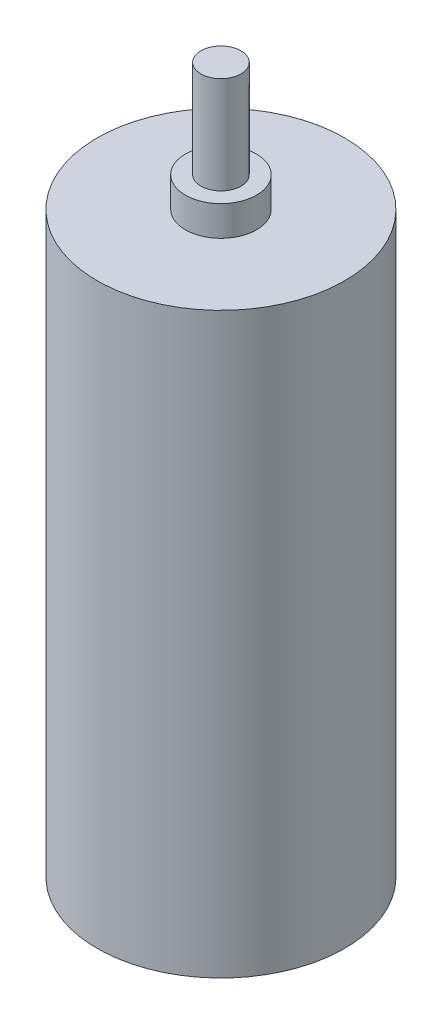
ISO-10303-21;
HEADER;
FILE_DESCRIPTION(('STEP AP214'),'2;1');
FILE_NAME('part.step','',(''),(''),'','','');
FILE_SCHEMA(('AUTOMOTIVE_DESIGN { 1 0 10303 214 1 1 1 1 }'));
ENDSEC;
DATA;
#1=APPLICATION_CONTEXT('core data for automotive mechanical design processes');
#2=APPLICATION_PROTOCOL_DEFINITION('international standard','automotive_design',2000,#1);
#3=PRODUCT_CONTEXT('',#1,'mechanical');
#4=PRODUCT('Part','Part','',(#3));
#5=PRODUCT_RELATED_PRODUCT_CATEGORY('part','',(#4));
#6=PRODUCT_DEFINITION_FORMATION('','',#4);
#7=PRODUCT_DEFINITION_CONTEXT('part definition',#1,'design');
#8=PRODUCT_DEFINITION('design','',#6,#7);
#9=PRODUCT_DEFINITION_SHAPE('','',#8);
#10=(LENGTH_UNIT() NAMED_UNIT(*) SI_UNIT(.MILLI.,.METRE.));
#11=(NAMED_UNIT(*) PLANE_ANGLE_UNIT() SI_UNIT($,.RADIAN.));
#12=(NAMED_UNIT(*) SI_UNIT($,.STERADIAN.) SOLID_ANGLE_UNIT());
#13=UNCERTAINTY_MEASURE_WITH_UNIT(LENGTH_MEASURE(1.E-05),#10,'distance_accuracy_value','');
#14=(GEOMETRIC_REPRESENTATION_CONTEXT(3) GLOBAL_UNCERTAINTY_ASSIGNED_CONTEXT((#13)) GLOBAL_UNIT_ASSIGNED_CONTEXT((#10,
#11,#12)) REPRESENTATION_CONTEXT('',''));
#15=CARTESIAN_POINT('',(0.,0.,0.));
#16=DIRECTION('',(0.,0.,1.));
#17=DIRECTION('',(1.,0.,0.));
#18=AXIS2_PLACEMENT_3D('',#15,#16,#17);
#19=CARTESIAN_POINT('',(0.,57.7,0.));
#20=DIRECTION('',(0.,-1.,0.));
#21=DIRECTION('',(0.,0.,1.));
#22=AXIS2_PLACEMENT_3D('',#19,#20,#21);
#23=CYLINDRICAL_SURFACE('',#22,12.35);
#24=CARTESIAN_POINT('',(0.,57.7,0.));
#25=DIRECTION('',(0.,-1.,0.));
#26=DIRECTION('',(0.,0.,-1.));
#27=AXIS2_PLACEMENT_3D('',#24,#25,#26);
#28=CIRCLE('',#27,12.35);
#29=CARTESIAN_POINT('',(0.,57.7,-12.35));
#30=VERTEX_POINT('',#29);
#31=EDGE_CURVE('E59',#30,#30,#28,.T.);
#32=ORIENTED_EDGE('',*,*,#31,.T.);
#33=EDGE_LOOP('',(#32));
#34=FACE_BOUND('',#33,.T.);
#35=CARTESIAN_POINT('',(0.,0.,0.));
#36=DIRECTION('',(0.,-1.,0.));
#37=DIRECTION('',(0.,0.,-1.));
#38=AXIS2_PLACEMENT_3D('',#35,#36,#37);
#39=CIRCLE('',#38,12.35);
#40=CARTESIAN_POINT('',(0.,0.,-12.35));
#41=VERTEX_POINT('',#40);
#42=EDGE_CURVE('E48',#41,#41,#39,.T.);
#43=ORIENTED_EDGE('',*,*,#42,.F.);
#44=EDGE_LOOP('',(#43));
#45=FACE_BOUND('',#44,.T.);
#46=ADVANCED_FACE('F45',(#34,#45),#23,.T.);
#47=CARTESIAN_POINT('',(0.,57.7,0.));
#48=DIRECTION('',(0.,1.,0.));
#49=DIRECTION('',(0.,0.,-1.));
#50=AXIS2_PLACEMENT_3D('',#47,#48,#49);
#51=PLANE('',#50);
#52=CARTESIAN_POINT('',(0.,57.7,0.));
#53=DIRECTION('',(0.,-1.,0.));
#54=DIRECTION('',(0.,0.,-1.));
#55=AXIS2_PLACEMENT_3D('',#52,#53,#54);
#56=CIRCLE('',#55,3.55);
#57=CARTESIAN_POINT('',(0.,57.7,-3.55));
#58=VERTEX_POINT('',#57);
#59=EDGE_CURVE('E53',#58,#58,#56,.T.);
#60=ORIENTED_EDGE('',*,*,#59,.T.);
#61=EDGE_LOOP('',(#60));
#62=FACE_BOUND('',#61,.T.);
#63=ORIENTED_EDGE('',*,*,#31,.F.);
#64=EDGE_LOOP('',(#63));
#65=FACE_BOUND('',#64,.T.);
#66=ADVANCED_FACE('F78',(#62,#65),#51,.T.);
#67=CARTESIAN_POINT('',(0.,0.,0.));
#68=DIRECTION('',(0.,1.,0.));
#69=DIRECTION('',(0.,0.,-1.));
#70=AXIS2_PLACEMENT_3D('',#67,#68,#69);
#71=PLANE('',#70);
#72=ORIENTED_EDGE('',*,*,#42,.T.);
#73=EDGE_LOOP('',(#72));
#74=FACE_BOUND('',#73,.T.);
#75=ADVANCED_FACE('F75',(#74),#71,.F.);
#76=CARTESIAN_POINT('',(0.,60.7,0.));
#77=DIRECTION('',(0.,-1.,0.));
#78=DIRECTION('',(0.,0.,1.));
#79=AXIS2_PLACEMENT_3D('',#76,#77,#78);
#80=CYLINDRICAL_SURFACE('',#79,3.55);
#81=CARTESIAN_POINT('',(0.,60.7,0.));
#82=DIRECTION('',(0.,-1.,0.));
#83=DIRECTION('',(0.,0.,-1.));
#84=AXIS2_PLACEMENT_3D('',#81,#82,#83);
#85=CIRCLE('',#84,3.55);
#86=CARTESIAN_POINT('',(0.,60.7,-3.55));
#87=VERTEX_POINT('',#86);
#88=EDGE_CURVE('E64',#87,#87,#85,.T.);
#89=ORIENTED_EDGE('',*,*,#88,.T.);
#90=EDGE_LOOP('',(#89));
#91=FACE_BOUND('',#90,.T.);
#92=ORIENTED_EDGE('',*,*,#59,.F.);
#93=EDGE_LOOP('',(#92));
#94=FACE_BOUND('',#93,.T.);
#95=ADVANCED_FACE('F87',(#91,#94),#80,.T.);
#96=CARTESIAN_POINT('',(0.,60.7,0.));
#97=DIRECTION('',(0.,1.,0.));
#98=DIRECTION('',(0.,0.,-1.));
#99=AXIS2_PLACEMENT_3D('',#96,#97,#98);
#100=PLANE('',#99);
#101=CARTESIAN_POINT('',(0.,60.7,0.));
#102=DIRECTION('',(0.,-1.,0.));
#103=DIRECTION('',(0.,0.,-1.));
#104=AXIS2_PLACEMENT_3D('',#101,#102,#103);
#105=CIRCLE('',#104,2.);
#106=CARTESIAN_POINT('',(0.,60.7,-2.));
#107=VERTEX_POINT('',#106);
#108=EDGE_CURVE('E10',#107,#107,#105,.T.);
#109=ORIENTED_EDGE('',*,*,#108,.T.);
#110=EDGE_LOOP('',(#109));
#111=FACE_BOUND('',#110,.T.);
#112=ORIENTED_EDGE('',*,*,#88,.F.);
#113=EDGE_LOOP('',(#112));
#114=FACE_BOUND('',#113,.T.);
#115=ADVANCED_FACE('F92',(#111,#114),#100,.T.);
#116=CARTESIAN_POINT('',(0.,70.4,0.));
#117=DIRECTION('',(0.,-1.,0.));
#118=DIRECTION('',(0.,0.,1.));
#119=AXIS2_PLACEMENT_3D('',#116,#117,#118);
#120=CYLINDRICAL_SURFACE('',#119,2.);
#121=CARTESIAN_POINT('',(0.,70.4,0.));
#122=DIRECTION('',(0.,-1.,0.));
#123=DIRECTION('',(0.,0.,-1.));
#124=AXIS2_PLACEMENT_3D('',#121,#122,#123);
#125=CIRCLE('',#124,2.);
#126=CARTESIAN_POINT('',(0.,70.4,-2.));
#127=VERTEX_POINT('',#126);
#128=EDGE_CURVE('E63',#127,#127,#125,.T.);
#129=ORIENTED_EDGE('',*,*,#128,.T.);
#130=EDGE_LOOP('',(#129));
#131=FACE_BOUND('',#130,.T.);
#132=ORIENTED_EDGE('',*,*,#108,.F.);
#133=EDGE_LOOP('',(#132));
#134=FACE_BOUND('',#133,.T.);
#135=ADVANCED_FACE('F96',(#131,#134),#120,.T.);
#136=CARTESIAN_POINT('',(0.,70.4,0.));
#137=DIRECTION('',(0.,1.,0.));
#138=DIRECTION('',(0.,0.,-1.));
#139=AXIS2_PLACEMENT_3D('',#136,#137,#138);
#140=PLANE('',#139);
#141=ORIENTED_EDGE('',*,*,#128,.F.);
#142=EDGE_LOOP('',(#141));
#143=FACE_BOUND('',#142,.T.);
#144=ADVANCED_FACE('F99',(#143),#140,.T.);
#145=CLOSED_SHELL('',(#46,#66,#75,#95,#115,#135,#144));
#146=MANIFOLD_SOLID_BREP('B2',#145);
#147=ADVANCED_BREP_SHAPE_REPRESENTATION('',(#18,#146),#14);
#148=SHAPE_DEFINITION_REPRESENTATION(#9,#147);
ENDSEC;
END-ISO-10303-21;
